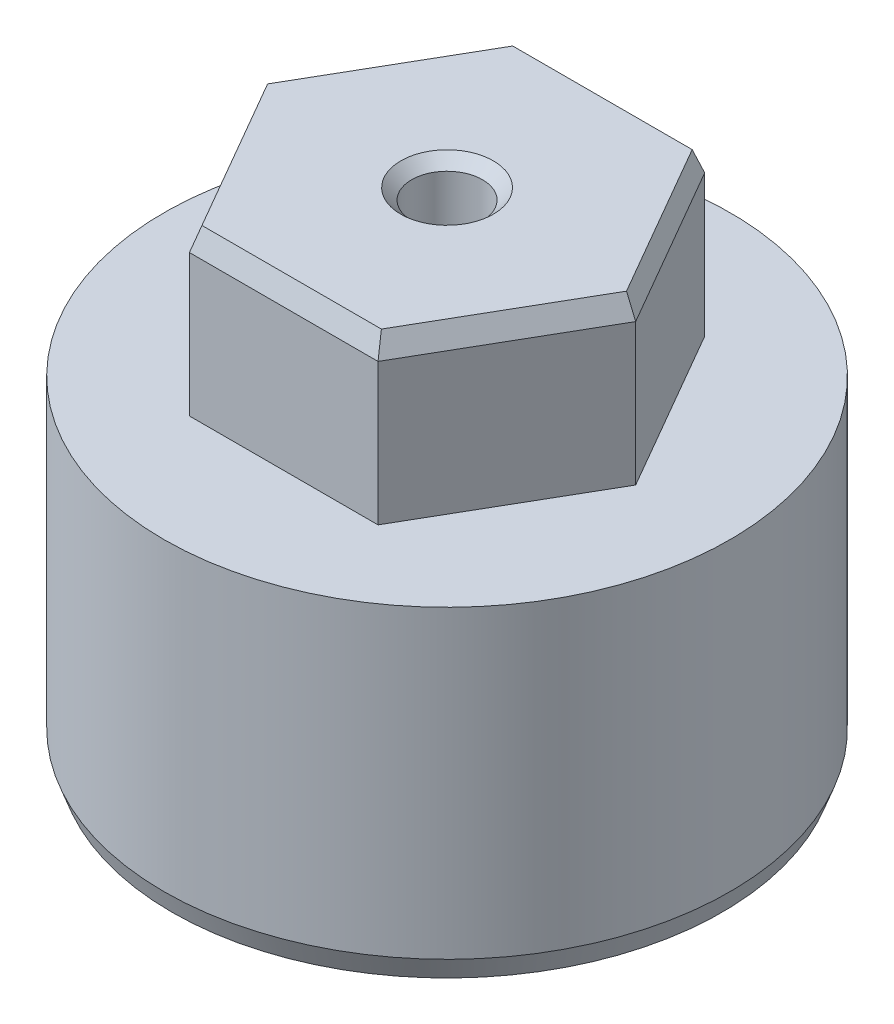
ISO-10303-21;
HEADER;
FILE_DESCRIPTION(('STEP AP214'),'2;1');
FILE_NAME('part.step','',(''),(''),'','','');
FILE_SCHEMA(('AUTOMOTIVE_DESIGN { 1 0 10303 214 1 1 1 1 }'));
ENDSEC;
DATA;
#1=APPLICATION_CONTEXT('core data for automotive mechanical design processes');
#2=APPLICATION_PROTOCOL_DEFINITION('international standard','automotive_design',2000,#1);
#3=PRODUCT_CONTEXT('',#1,'mechanical');
#4=PRODUCT('Part','Part','',(#3));
#5=PRODUCT_RELATED_PRODUCT_CATEGORY('part','',(#4));
#6=PRODUCT_DEFINITION_FORMATION('','',#4);
#7=PRODUCT_DEFINITION_CONTEXT('part definition',#1,'design');
#8=PRODUCT_DEFINITION('design','',#6,#7);
#9=PRODUCT_DEFINITION_SHAPE('','',#8);
#10=(LENGTH_UNIT() NAMED_UNIT(*) SI_UNIT(.MILLI.,.METRE.));
#11=(NAMED_UNIT(*) PLANE_ANGLE_UNIT() SI_UNIT($,.RADIAN.));
#12=(NAMED_UNIT(*) SI_UNIT($,.STERADIAN.) SOLID_ANGLE_UNIT());
#13=UNCERTAINTY_MEASURE_WITH_UNIT(LENGTH_MEASURE(1.E-05),#10,'distance_accuracy_value','');
#14=(GEOMETRIC_REPRESENTATION_CONTEXT(3) GLOBAL_UNCERTAINTY_ASSIGNED_CONTEXT((#13)) GLOBAL_UNIT_ASSIGNED_CONTEXT((#10,
#11,#12)) REPRESENTATION_CONTEXT('',''));
#15=CARTESIAN_POINT('',(0.,0.,0.));
#16=DIRECTION('',(0.,0.,1.));
#17=DIRECTION('',(1.,0.,0.));
#18=AXIS2_PLACEMENT_3D('',#15,#16,#17);
#19=CARTESIAN_POINT('',(0.,15.,0.));
#20=DIRECTION('',(0.,-1.,0.));
#21=DIRECTION('',(0.,0.,-1.));
#22=AXIS2_PLACEMENT_3D('',#19,#20,#21);
#23=CYLINDRICAL_SURFACE('',#22,26.);
#24=CARTESIAN_POINT('',(0.,-12.9999999999999,0.));
#25=DIRECTION('',(0.,1.,0.));
#26=DIRECTION('',(0.,0.,1.));
#27=AXIS2_PLACEMENT_3D('',#24,#25,#26);
#28=CIRCLE('',#27,26.);
#29=CARTESIAN_POINT('',(0.,-12.9999999999999,26.));
#30=VERTEX_POINT('',#29);
#31=EDGE_CURVE('E186',#30,#30,#28,.T.);
#32=ORIENTED_EDGE('',*,*,#31,.T.);
#33=EDGE_LOOP('',(#32));
#34=FACE_BOUND('',#33,.T.);
#35=CARTESIAN_POINT('',(0.,15.,0.));
#36=DIRECTION('',(0.,1.,0.));
#37=DIRECTION('',(0.,0.,1.));
#38=AXIS2_PLACEMENT_3D('',#35,#36,#37);
#39=CIRCLE('',#38,26.);
#40=CARTESIAN_POINT('',(0.,15.,26.));
#41=VERTEX_POINT('',#40);
#42=EDGE_CURVE('E160',#41,#41,#39,.T.);
#43=ORIENTED_EDGE('',*,*,#42,.F.);
#44=EDGE_LOOP('',(#43));
#45=FACE_BOUND('',#44,.T.);
#46=ADVANCED_FACE('F39',(#34,#45),#23,.T.);
#47=CARTESIAN_POINT('',(0.,15.,0.));
#48=DIRECTION('',(0.,1.,0.));
#49=DIRECTION('',(0.,0.,1.));
#50=AXIS2_PLACEMENT_3D('',#47,#48,#49);
#51=PLANE('',#50);
#52=DIRECTION('',(-0.5,0.,0.866025403784438));
#53=VECTOR('',#52,1.);
#54=CARTESIAN_POINT('',(-8.66025403784439,15.,-15.));
#55=LINE('',#54,#53);
#56=CARTESIAN_POINT('',(-8.66025403784439,15.,-15.));
#57=VERTEX_POINT('',#56);
#58=CARTESIAN_POINT('',(-17.3205080756888,15.,0.));
#59=VERTEX_POINT('',#58);
#60=EDGE_CURVE('E139',#57,#59,#55,.T.);
#61=ORIENTED_EDGE('',*,*,#60,.F.);
#62=DIRECTION('',(-1.,0.,0.));
#63=VECTOR('',#62,1.);
#64=CARTESIAN_POINT('',(8.66025403784438,15.,-15.));
#65=LINE('',#64,#63);
#66=CARTESIAN_POINT('',(8.66025403784438,15.,-15.));
#67=VERTEX_POINT('',#66);
#68=EDGE_CURVE('E149',#67,#57,#65,.T.);
#69=ORIENTED_EDGE('',*,*,#68,.F.);
#70=DIRECTION('',(-0.5,0.,-0.866025403784439));
#71=VECTOR('',#70,1.);
#72=CARTESIAN_POINT('',(17.3205080756888,15.,0.));
#73=LINE('',#72,#71);
#74=CARTESIAN_POINT('',(17.3205080756888,15.,0.));
#75=VERTEX_POINT('',#74);
#76=EDGE_CURVE('E146',#75,#67,#73,.T.);
#77=ORIENTED_EDGE('',*,*,#76,.F.);
#78=DIRECTION('',(0.5,0.,-0.866025403784439));
#79=VECTOR('',#78,1.);
#80=CARTESIAN_POINT('',(8.66025403784439,15.,15.));
#81=LINE('',#80,#79);
#82=CARTESIAN_POINT('',(8.66025403784439,15.,15.));
#83=VERTEX_POINT('',#82);
#84=EDGE_CURVE('E135',#83,#75,#81,.T.);
#85=ORIENTED_EDGE('',*,*,#84,.F.);
#86=DIRECTION('',(1.,0.,0.));
#87=VECTOR('',#86,1.);
#88=CARTESIAN_POINT('',(-8.66025403784438,15.,15.));
#89=LINE('',#88,#87);
#90=CARTESIAN_POINT('',(-8.66025403784438,15.,15.));
#91=VERTEX_POINT('',#90);
#92=EDGE_CURVE('E116',#91,#83,#89,.T.);
#93=ORIENTED_EDGE('',*,*,#92,.F.);
#94=DIRECTION('',(0.5,0.,0.866025403784439));
#95=VECTOR('',#94,1.);
#96=CARTESIAN_POINT('',(-17.3205080756888,15.,0.));
#97=LINE('',#96,#95);
#98=EDGE_CURVE('E131',#59,#91,#97,.T.);
#99=ORIENTED_EDGE('',*,*,#98,.F.);
#100=EDGE_LOOP('',(#61,#69,#77,#85,#93,#99));
#101=FACE_BOUND('',#100,.T.);
#102=ORIENTED_EDGE('',*,*,#42,.T.);
#103=EDGE_LOOP('',(#102));
#104=FACE_BOUND('',#103,.T.);
#105=ADVANCED_FACE('F129',(#101,#104),#51,.T.);
#106=CARTESIAN_POINT('',(0.,-15.,0.));
#107=DIRECTION('',(0.,1.,0.));
#108=DIRECTION('',(0.,0.,1.));
#109=AXIS2_PLACEMENT_3D('',#106,#107,#108);
#110=PLANE('',#109);
#111=CARTESIAN_POINT('',(0.,-15.,0.));
#112=DIRECTION('',(0.,1.,0.));
#113=DIRECTION('',(0.,0.,1.));
#114=AXIS2_PLACEMENT_3D('',#111,#112,#113);
#115=CIRCLE('',#114,25.2720595314676);
#116=CARTESIAN_POINT('',(0.,-15.,25.2720595314676));
#117=VERTEX_POINT('',#116);
#118=EDGE_CURVE('E205',#117,#117,#115,.F.);
#119=ORIENTED_EDGE('',*,*,#118,.T.);
#120=EDGE_LOOP('',(#119));
#121=FACE_BOUND('',#120,.T.);
#122=ADVANCED_FACE('F228',(#121),#110,.F.);
#123=CARTESIAN_POINT('',(-8.66025403784439,30.,-15.));
#124=DIRECTION('',(0.866025403784438,0.,0.5));
#125=DIRECTION('',(0.5,0.,-0.866025403784439));
#126=AXIS2_PLACEMENT_3D('',#123,#124,#125);
#127=PLANE('',#126);
#128=DIRECTION('',(0.,-1.,0.));
#129=VECTOR('',#128,1.);
#130=CARTESIAN_POINT('',(-17.3205080756888,30.,0.));
#131=LINE('',#130,#129);
#132=CARTESIAN_POINT('',(-17.3205080756888,28.,0.));
#133=VERTEX_POINT('',#132);
#134=EDGE_CURVE('E122',#133,#59,#131,.T.);
#135=ORIENTED_EDGE('',*,*,#134,.F.);
#136=DIRECTION('',(0.5,0.,-0.866025403784439));
#137=VECTOR('',#136,1.);
#138=CARTESIAN_POINT('',(-8.66025403784439,28.,-15.));
#139=LINE('',#138,#137);
#140=CARTESIAN_POINT('',(-8.66025403784439,28.,-15.));
#141=VERTEX_POINT('',#140);
#142=EDGE_CURVE('E176',#133,#141,#139,.T.);
#143=ORIENTED_EDGE('',*,*,#142,.T.);
#144=DIRECTION('',(0.,-1.,0.));
#145=VECTOR('',#144,1.);
#146=CARTESIAN_POINT('',(-8.66025403784439,30.,-15.));
#147=LINE('',#146,#145);
#148=EDGE_CURVE('E152',#141,#57,#147,.T.);
#149=ORIENTED_EDGE('',*,*,#148,.T.);
#150=ORIENTED_EDGE('',*,*,#60,.T.);
#151=EDGE_LOOP('',(#135,#143,#149,#150));
#152=FACE_BOUND('',#151,.T.);
#153=ADVANCED_FACE('F290',(#152),#127,.F.);
#154=CARTESIAN_POINT('',(-17.3205080756888,30.,0.));
#155=DIRECTION('',(0.866025403784439,0.,-0.5));
#156=DIRECTION('',(-0.5,0.,-0.866025403784439));
#157=AXIS2_PLACEMENT_3D('',#154,#155,#156);
#158=PLANE('',#157);
#159=DIRECTION('',(0.,-1.,0.));
#160=VECTOR('',#159,1.);
#161=CARTESIAN_POINT('',(-8.66025403784438,30.,15.));
#162=LINE('',#161,#160);
#163=CARTESIAN_POINT('',(-8.66025403784438,28.,15.));
#164=VERTEX_POINT('',#163);
#165=EDGE_CURVE('E112',#164,#91,#162,.T.);
#166=ORIENTED_EDGE('',*,*,#165,.F.);
#167=DIRECTION('',(-0.5,0.,-0.866025403784439));
#168=VECTOR('',#167,1.);
#169=CARTESIAN_POINT('',(-17.3205080756888,28.,0.));
#170=LINE('',#169,#168);
#171=EDGE_CURVE('E179',#164,#133,#170,.T.);
#172=ORIENTED_EDGE('',*,*,#171,.T.);
#173=ORIENTED_EDGE('',*,*,#134,.T.);
#174=ORIENTED_EDGE('',*,*,#98,.T.);
#175=EDGE_LOOP('',(#166,#172,#173,#174));
#176=FACE_BOUND('',#175,.T.);
#177=ADVANCED_FACE('F137',(#176),#158,.F.);
#178=CARTESIAN_POINT('',(-8.66025403784438,30.,15.));
#179=DIRECTION('',(0.,0.,-1.));
#180=DIRECTION('',(-1.,0.,0.));
#181=AXIS2_PLACEMENT_3D('',#178,#179,#180);
#182=PLANE('',#181);
#183=DIRECTION('',(0.,-1.,0.));
#184=VECTOR('',#183,1.);
#185=CARTESIAN_POINT('',(8.66025403784439,30.,15.));
#186=LINE('',#185,#184);
#187=CARTESIAN_POINT('',(8.66025403784439,28.,15.));
#188=VERTEX_POINT('',#187);
#189=EDGE_CURVE('E123',#188,#83,#186,.T.);
#190=ORIENTED_EDGE('',*,*,#189,.F.);
#191=DIRECTION('',(-1.,0.,0.));
#192=VECTOR('',#191,1.);
#193=CARTESIAN_POINT('',(-8.66025403784438,28.,15.));
#194=LINE('',#193,#192);
#195=EDGE_CURVE('E118',#188,#164,#194,.T.);
#196=ORIENTED_EDGE('',*,*,#195,.T.);
#197=ORIENTED_EDGE('',*,*,#165,.T.);
#198=ORIENTED_EDGE('',*,*,#92,.T.);
#199=EDGE_LOOP('',(#190,#196,#197,#198));
#200=FACE_BOUND('',#199,.T.);
#201=ADVANCED_FACE('F115',(#200),#182,.F.);
#202=CARTESIAN_POINT('',(8.66025403784439,30.,15.));
#203=DIRECTION('',(-0.866025403784439,0.,-0.5));
#204=DIRECTION('',(-0.5,0.,0.866025403784439));
#205=AXIS2_PLACEMENT_3D('',#202,#203,#204);
#206=PLANE('',#205);
#207=DIRECTION('',(0.,-1.,0.));
#208=VECTOR('',#207,1.);
#209=CARTESIAN_POINT('',(17.3205080756888,30.,0.));
#210=LINE('',#209,#208);
#211=CARTESIAN_POINT('',(17.3205080756888,28.,0.));
#212=VERTEX_POINT('',#211);
#213=EDGE_CURVE('E156',#212,#75,#210,.T.);
#214=ORIENTED_EDGE('',*,*,#213,.F.);
#215=DIRECTION('',(-0.5,0.,0.866025403784439));
#216=VECTOR('',#215,1.);
#217=CARTESIAN_POINT('',(8.66025403784439,28.,15.));
#218=LINE('',#217,#216);
#219=EDGE_CURVE('E182',#212,#188,#218,.T.);
#220=ORIENTED_EDGE('',*,*,#219,.T.);
#221=ORIENTED_EDGE('',*,*,#189,.T.);
#222=ORIENTED_EDGE('',*,*,#84,.T.);
#223=EDGE_LOOP('',(#214,#220,#221,#222));
#224=FACE_BOUND('',#223,.T.);
#225=ADVANCED_FACE('F303',(#224),#206,.F.);
#226=CARTESIAN_POINT('',(17.3205080756888,30.,0.));
#227=DIRECTION('',(-0.866025403784438,0.,0.5));
#228=DIRECTION('',(0.5,0.,0.866025403784439));
#229=AXIS2_PLACEMENT_3D('',#226,#227,#228);
#230=PLANE('',#229);
#231=DIRECTION('',(0.,-1.,0.));
#232=VECTOR('',#231,1.);
#233=CARTESIAN_POINT('',(8.66025403784438,30.,-15.));
#234=LINE('',#233,#232);
#235=CARTESIAN_POINT('',(8.66025403784438,28.,-15.));
#236=VERTEX_POINT('',#235);
#237=EDGE_CURVE('E154',#236,#67,#234,.T.);
#238=ORIENTED_EDGE('',*,*,#237,.F.);
#239=DIRECTION('',(0.5,0.,0.866025403784439));
#240=VECTOR('',#239,1.);
#241=CARTESIAN_POINT('',(17.3205080756888,28.,0.));
#242=LINE('',#241,#240);
#243=EDGE_CURVE('E62',#236,#212,#242,.T.);
#244=ORIENTED_EDGE('',*,*,#243,.T.);
#245=ORIENTED_EDGE('',*,*,#213,.T.);
#246=ORIENTED_EDGE('',*,*,#76,.T.);
#247=EDGE_LOOP('',(#238,#244,#245,#246));
#248=FACE_BOUND('',#247,.T.);
#249=ADVANCED_FACE('F306',(#248),#230,.F.);
#250=CARTESIAN_POINT('',(8.66025403784438,30.,-15.));
#251=DIRECTION('',(0.,0.,1.));
#252=DIRECTION('',(1.,0.,0.));
#253=AXIS2_PLACEMENT_3D('',#250,#251,#252);
#254=PLANE('',#253);
#255=ORIENTED_EDGE('',*,*,#148,.F.);
#256=DIRECTION('',(1.,0.,0.));
#257=VECTOR('',#256,1.);
#258=CARTESIAN_POINT('',(8.66025403784438,28.,-15.));
#259=LINE('',#258,#257);
#260=EDGE_CURVE('E55',#141,#236,#259,.T.);
#261=ORIENTED_EDGE('',*,*,#260,.T.);
#262=ORIENTED_EDGE('',*,*,#237,.T.);
#263=ORIENTED_EDGE('',*,*,#68,.T.);
#264=EDGE_LOOP('',(#255,#261,#262,#263));
#265=FACE_BOUND('',#264,.T.);
#266=ADVANCED_FACE('F310',(#265),#254,.F.);
#267=CARTESIAN_POINT('',(0.,30.,0.));
#268=DIRECTION('',(0.,1.,0.));
#269=DIRECTION('',(0.,0.,1.));
#270=AXIS2_PLACEMENT_3D('',#267,#268,#269);
#271=PLANE('',#270);
#272=CARTESIAN_POINT('',(0.,30.,0.));
#273=DIRECTION('',(0.,1.,0.));
#274=DIRECTION('',(0.,0.,1.));
#275=AXIS2_PLACEMENT_3D('',#272,#273,#274);
#276=CIRCLE('',#275,4.24999999999999);
#277=CARTESIAN_POINT('',(0.,30.,4.24999999999999));
#278=VERTEX_POINT('',#277);
#279=EDGE_CURVE('E11',#278,#278,#276,.F.);
#280=ORIENTED_EDGE('',*,*,#279,.T.);
#281=EDGE_LOOP('',(#280));
#282=FACE_BOUND('',#281,.T.);
#283=DIRECTION('',(-1.,0.,0.));
#284=VECTOR('',#283,1.);
#285=CARTESIAN_POINT('',(-8.66025403784439,30.,-14.2720595314676));
#286=LINE('',#285,#284);
#287=CARTESIAN_POINT('',(8.23997741238317,30.,-14.2720595314676));
#288=VERTEX_POINT('',#287);
#289=CARTESIAN_POINT('',(-8.23997741238318,30.,-14.2720595314676));
#290=VERTEX_POINT('',#289);
#291=EDGE_CURVE('E163',#288,#290,#286,.T.);
#292=ORIENTED_EDGE('',*,*,#291,.T.);
#293=DIRECTION('',(-0.5,0.,0.866025403784439));
#294=VECTOR('',#293,1.);
#295=CARTESIAN_POINT('',(-16.690093137497,30.,0.3639702342662));
#296=LINE('',#295,#294);
#297=CARTESIAN_POINT('',(-16.4799548247664,30.,0.));
#298=VERTEX_POINT('',#297);
#299=EDGE_CURVE('E173',#290,#298,#296,.T.);
#300=ORIENTED_EDGE('',*,*,#299,.T.);
#301=DIRECTION('',(0.5,0.,0.866025403784439));
#302=VECTOR('',#301,1.);
#303=CARTESIAN_POINT('',(-8.02983909965257,30.,14.6360297657338));
#304=LINE('',#303,#302);
#305=CARTESIAN_POINT('',(-8.23997741238317,30.,14.2720595314676));
#306=VERTEX_POINT('',#305);
#307=EDGE_CURVE('E171',#298,#306,#304,.T.);
#308=ORIENTED_EDGE('',*,*,#307,.T.);
#309=DIRECTION('',(1.,0.,0.));
#310=VECTOR('',#309,1.);
#311=CARTESIAN_POINT('',(8.66025403784439,30.,14.2720595314676));
#312=LINE('',#311,#310);
#313=CARTESIAN_POINT('',(8.23997741238317,30.,14.2720595314676));
#314=VERTEX_POINT('',#313);
#315=EDGE_CURVE('E169',#306,#314,#312,.T.);
#316=ORIENTED_EDGE('',*,*,#315,.T.);
#317=DIRECTION('',(0.5,0.,-0.866025403784439));
#318=VECTOR('',#317,1.);
#319=CARTESIAN_POINT('',(16.690093137497,30.,-0.363970234266202));
#320=LINE('',#319,#318);
#321=CARTESIAN_POINT('',(16.4799548247664,30.,0.));
#322=VERTEX_POINT('',#321);
#323=EDGE_CURVE('E167',#314,#322,#320,.T.);
#324=ORIENTED_EDGE('',*,*,#323,.T.);
#325=DIRECTION('',(-0.5,0.,-0.866025403784439));
#326=VECTOR('',#325,1.);
#327=CARTESIAN_POINT('',(8.02983909965257,30.,-14.6360297657338));
#328=LINE('',#327,#326);
#329=EDGE_CURVE('E165',#322,#288,#328,.T.);
#330=ORIENTED_EDGE('',*,*,#329,.T.);
#331=EDGE_LOOP('',(#292,#300,#308,#316,#324,#330));
#332=FACE_BOUND('',#331,.T.);
#333=ADVANCED_FACE('F275',(#282,#332),#271,.T.);
#334=CARTESIAN_POINT('',(12.3599661185748,30.,7.1360297657338));
#335=DIRECTION('',(0.813797681349374,0.342020143325667,0.469846310392955));
#336=DIRECTION('',(-0.5,0.,0.866025403784439));
#337=AXIS2_PLACEMENT_3D('',#334,#335,#336);
#338=PLANE('',#337);
#339=DIRECTION('',(0.193724626205287,-0.921891033043758,0.335540895264846));
#340=VECTOR('',#339,1.);
#341=CARTESIAN_POINT('',(7.93073739830042,31.4716022512239,13.736440115343));
#342=LINE('',#341,#340);
#343=EDGE_CURVE('E198',#188,#314,#342,.F.);
#344=ORIENTED_EDGE('',*,*,#343,.F.);
#345=ORIENTED_EDGE('',*,*,#219,.F.);
#346=DIRECTION('',(0.387449252410574,-0.921891033043758,0.));
#347=VECTOR('',#346,1.);
#348=CARTESIAN_POINT('',(15.8614747966008,31.4716022512239,0.));
#349=LINE('',#348,#347);
#350=EDGE_CURVE('E141',#322,#212,#349,.T.);
#351=ORIENTED_EDGE('',*,*,#350,.F.);
#352=ORIENTED_EDGE('',*,*,#323,.F.);
#353=EDGE_LOOP('',(#344,#345,#351,#352));
#354=FACE_BOUND('',#353,.T.);
#355=ADVANCED_FACE('F270',(#354),#338,.T.);
#356=CARTESIAN_POINT('',(12.3599661185748,30.,-7.1360297657338));
#357=DIRECTION('',(0.813797681349374,0.342020143325667,-0.469846310392955));
#358=DIRECTION('',(0.5,0.,0.866025403784439));
#359=AXIS2_PLACEMENT_3D('',#356,#357,#358);
#360=PLANE('',#359);
#361=ORIENTED_EDGE('',*,*,#350,.T.);
#362=ORIENTED_EDGE('',*,*,#243,.F.);
#363=DIRECTION('',(0.193724626205287,-0.921891033043758,-0.335540895264846));
#364=VECTOR('',#363,1.);
#365=CARTESIAN_POINT('',(7.93073739830042,31.4716022512239,-13.736440115343));
#366=LINE('',#365,#364);
#367=EDGE_CURVE('E195',#288,#236,#366,.T.);
#368=ORIENTED_EDGE('',*,*,#367,.F.);
#369=ORIENTED_EDGE('',*,*,#329,.F.);
#370=EDGE_LOOP('',(#361,#362,#368,#369));
#371=FACE_BOUND('',#370,.T.);
#372=ADVANCED_FACE('F263',(#371),#360,.T.);
#373=CARTESIAN_POINT('',(0.,30.,14.2720595314676));
#374=DIRECTION('',(0.,0.342020143325667,0.939692620785909));
#375=DIRECTION('',(-1.,0.,0.));
#376=AXIS2_PLACEMENT_3D('',#373,#374,#375);
#377=PLANE('',#376);
#378=ORIENTED_EDGE('',*,*,#343,.T.);
#379=ORIENTED_EDGE('',*,*,#315,.F.);
#380=DIRECTION('',(-0.193724626205289,-0.921891033043758,0.335540895264846));
#381=VECTOR('',#380,1.);
#382=CARTESIAN_POINT('',(-7.93073739830042,31.4716022512239,13.7364401153429));
#383=LINE('',#382,#381);
#384=EDGE_CURVE('E192',#164,#306,#383,.F.);
#385=ORIENTED_EDGE('',*,*,#384,.F.);
#386=ORIENTED_EDGE('',*,*,#195,.F.);
#387=EDGE_LOOP('',(#378,#379,#385,#386));
#388=FACE_BOUND('',#387,.T.);
#389=ADVANCED_FACE('F256',(#388),#377,.T.);
#390=CARTESIAN_POINT('',(0.,30.,-14.2720595314676));
#391=DIRECTION('',(0.,0.342020143325667,-0.939692620785909));
#392=DIRECTION('',(1.,0.,0.));
#393=AXIS2_PLACEMENT_3D('',#390,#391,#392);
#394=PLANE('',#393);
#395=ORIENTED_EDGE('',*,*,#367,.T.);
#396=ORIENTED_EDGE('',*,*,#260,.F.);
#397=DIRECTION('',(0.193724626205285,0.921891033043759,0.335540895264846));
#398=VECTOR('',#397,1.);
#399=CARTESIAN_POINT('',(-7.93073739830043,31.4716022512239,-13.736440115343));
#400=LINE('',#399,#398);
#401=EDGE_CURVE('E189',#290,#141,#400,.F.);
#402=ORIENTED_EDGE('',*,*,#401,.F.);
#403=ORIENTED_EDGE('',*,*,#291,.F.);
#404=EDGE_LOOP('',(#395,#396,#402,#403));
#405=FACE_BOUND('',#404,.T.);
#406=ADVANCED_FACE('F249',(#405),#394,.T.);
#407=CARTESIAN_POINT('',(-12.3599661185748,30.,7.13602976573379));
#408=DIRECTION('',(-0.813797681349374,0.342020143325668,0.469846310392954));
#409=DIRECTION('',(-0.5,0.,-0.866025403784439));
#410=AXIS2_PLACEMENT_3D('',#407,#408,#409);
#411=PLANE('',#410);
#412=ORIENTED_EDGE('',*,*,#384,.T.);
#413=ORIENTED_EDGE('',*,*,#307,.F.);
#414=DIRECTION('',(-0.387449252410574,-0.921891033043758,0.));
#415=VECTOR('',#414,1.);
#416=CARTESIAN_POINT('',(-15.8614747966009,31.4716022512239,0.));
#417=LINE('',#416,#415);
#418=EDGE_CURVE('E187',#133,#298,#417,.F.);
#419=ORIENTED_EDGE('',*,*,#418,.F.);
#420=ORIENTED_EDGE('',*,*,#171,.F.);
#421=EDGE_LOOP('',(#412,#413,#419,#420));
#422=FACE_BOUND('',#421,.T.);
#423=ADVANCED_FACE('F242',(#422),#411,.T.);
#424=CARTESIAN_POINT('',(-12.3599661185748,30.,-7.1360297657338));
#425=DIRECTION('',(-0.813797681349375,0.342020143325666,-0.469846310392955));
#426=DIRECTION('',(0.5,0.,-0.866025403784439));
#427=AXIS2_PLACEMENT_3D('',#424,#425,#426);
#428=PLANE('',#427);
#429=ORIENTED_EDGE('',*,*,#401,.T.);
#430=ORIENTED_EDGE('',*,*,#142,.F.);
#431=ORIENTED_EDGE('',*,*,#418,.T.);
#432=ORIENTED_EDGE('',*,*,#299,.F.);
#433=EDGE_LOOP('',(#429,#430,#431,#432));
#434=FACE_BOUND('',#433,.T.);
#435=ADVANCED_FACE('F234',(#434),#428,.T.);
#436=CARTESIAN_POINT('',(0.,-12.9999999999999,0.));
#437=DIRECTION('',(0.,1.,0.));
#438=DIRECTION('',(0.,0.,1.));
#439=AXIS2_PLACEMENT_3D('',#436,#437,#438);
#440=CONICAL_SURFACE('',#439,26.,0.349065850398862);
#441=ORIENTED_EDGE('',*,*,#118,.F.);
#442=EDGE_LOOP('',(#441));
#443=FACE_BOUND('',#442,.T.);
#444=ORIENTED_EDGE('',*,*,#31,.F.);
#445=EDGE_LOOP('',(#444));
#446=FACE_BOUND('',#445,.T.);
#447=ADVANCED_FACE('F241',(#443,#446),#440,.T.);
#448=CARTESIAN_POINT('',(0.,12.,0.));
#449=DIRECTION('',(0.,1.,0.));
#450=DIRECTION('',(0.,0.,1.));
#451=AXIS2_PLACEMENT_3D('',#448,#449,#450);
#452=CYLINDRICAL_SURFACE('',#451,3.25);
#453=CARTESIAN_POINT('',(0.,29.,0.));
#454=DIRECTION('',(0.,1.,0.));
#455=DIRECTION('',(0.,0.,1.));
#456=AXIS2_PLACEMENT_3D('',#453,#454,#455);
#457=CIRCLE('',#456,3.25);
#458=CARTESIAN_POINT('',(0.,29.,3.25));
#459=VERTEX_POINT('',#458);
#460=EDGE_CURVE('E48',#459,#459,#457,.T.);
#461=ORIENTED_EDGE('',*,*,#460,.T.);
#462=EDGE_LOOP('',(#461));
#463=FACE_BOUND('',#462,.T.);
#464=CARTESIAN_POINT('',(0.,12.,0.));
#465=DIRECTION('',(0.,1.,0.));
#466=DIRECTION('',(0.,0.,1.));
#467=AXIS2_PLACEMENT_3D('',#464,#465,#466);
#468=CIRCLE('',#467,3.25);
#469=CARTESIAN_POINT('',(0.,12.,3.25));
#470=VERTEX_POINT('',#469);
#471=EDGE_CURVE('E190',#470,#470,#468,.T.);
#472=ORIENTED_EDGE('',*,*,#471,.F.);
#473=EDGE_LOOP('',(#472));
#474=FACE_BOUND('',#473,.T.);
#475=ADVANCED_FACE('F210',(#463,#474),#452,.F.);
#476=CARTESIAN_POINT('',(0.,12.,0.));
#477=DIRECTION('',(0.,1.,0.));
#478=DIRECTION('',(0.,0.,1.));
#479=AXIS2_PLACEMENT_3D('',#476,#477,#478);
#480=PLANE('',#479);
#481=ORIENTED_EDGE('',*,*,#471,.T.);
#482=EDGE_LOOP('',(#481));
#483=FACE_BOUND('',#482,.T.);
#484=ADVANCED_FACE('F214',(#483),#480,.T.);
#485=CARTESIAN_POINT('',(0.,29.,0.));
#486=DIRECTION('',(0.,1.,0.));
#487=DIRECTION('',(0.,0.,1.));
#488=AXIS2_PLACEMENT_3D('',#485,#486,#487);
#489=CONICAL_SURFACE('',#488,3.25,0.78539816339745);
#490=ORIENTED_EDGE('',*,*,#279,.F.);
#491=EDGE_LOOP('',(#490));
#492=FACE_BOUND('',#491,.T.);
#493=ORIENTED_EDGE('',*,*,#460,.F.);
#494=EDGE_LOOP('',(#493));
#495=FACE_BOUND('',#494,.T.);
#496=ADVANCED_FACE('F42',(#492,#495),#489,.F.);
#497=CLOSED_SHELL('',(#46,#105,#122,#153,#177,#201,#225,#249,#266,#333,#355,#372,#389,#406,#423,
#435,#447,#475,#484,#496));
#498=MANIFOLD_SOLID_BREP('B2',#497);
#499=ADVANCED_BREP_SHAPE_REPRESENTATION('',(#18,#498),#14);
#500=SHAPE_DEFINITION_REPRESENTATION(#9,#499);
ENDSEC;
END-ISO-10303-21;
